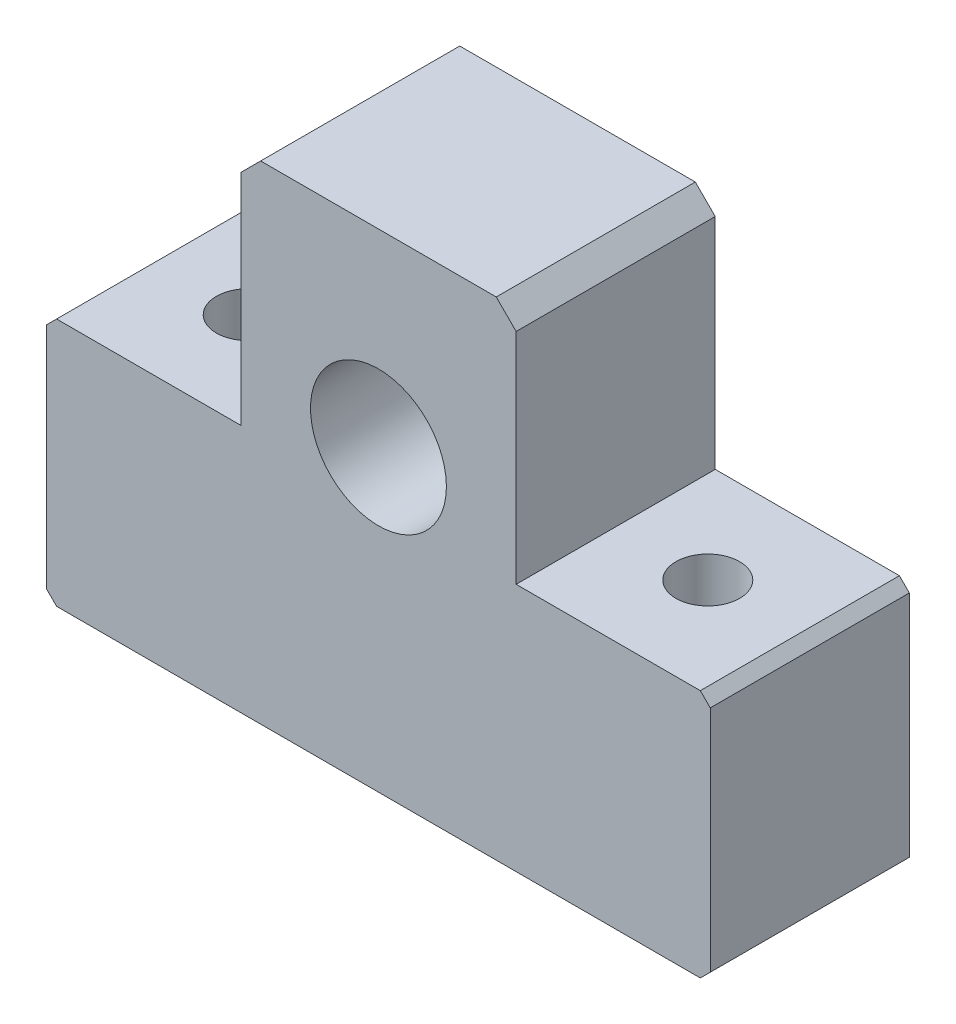
ISO-10303-21;
HEADER;
FILE_DESCRIPTION(('STEP AP214'),'2;1');
FILE_NAME('part.step','',(''),(''),'','','');
FILE_SCHEMA(('AUTOMOTIVE_DESIGN { 1 0 10303 214 1 1 1 1 }'));
ENDSEC;
DATA;
#1=APPLICATION_CONTEXT('core data for automotive mechanical design processes');
#2=APPLICATION_PROTOCOL_DEFINITION('international standard','automotive_design',2000,#1);
#3=PRODUCT_CONTEXT('',#1,'mechanical');
#4=PRODUCT('Part','Part','',(#3));
#5=PRODUCT_RELATED_PRODUCT_CATEGORY('part','',(#4));
#6=PRODUCT_DEFINITION_FORMATION('','',#4);
#7=PRODUCT_DEFINITION_CONTEXT('part definition',#1,'design');
#8=PRODUCT_DEFINITION('design','',#6,#7);
#9=PRODUCT_DEFINITION_SHAPE('','',#8);
#10=(LENGTH_UNIT() NAMED_UNIT(*) SI_UNIT(.MILLI.,.METRE.));
#11=(NAMED_UNIT(*) PLANE_ANGLE_UNIT() SI_UNIT($,.RADIAN.));
#12=(NAMED_UNIT(*) SI_UNIT($,.STERADIAN.) SOLID_ANGLE_UNIT());
#13=UNCERTAINTY_MEASURE_WITH_UNIT(LENGTH_MEASURE(1.E-05),#10,'distance_accuracy_value','');
#14=(GEOMETRIC_REPRESENTATION_CONTEXT(3) GLOBAL_UNCERTAINTY_ASSIGNED_CONTEXT((#13)) GLOBAL_UNIT_ASSIGNED_CONTEXT((#10,
#11,#12)) REPRESENTATION_CONTEXT('',''));
#15=CARTESIAN_POINT('',(0.,0.,0.));
#16=DIRECTION('',(0.,0.,1.));
#17=DIRECTION('',(1.,0.,0.));
#18=AXIS2_PLACEMENT_3D('',#15,#16,#17);
#19=CARTESIAN_POINT('',(0.,0.,150.));
#20=DIRECTION('',(0.,0.,-1.));
#21=DIRECTION('',(-1.,0.,0.));
#22=AXIS2_PLACEMENT_3D('',#19,#20,#21);
#23=PLANE('',#22);
#24=DIRECTION('',(0.,-1.,0.));
#25=VECTOR('',#24,1.);
#26=CARTESIAN_POINT('',(-250.,-176.25,150.));
#27=LINE('',#26,#25);
#28=CARTESIAN_POINT('',(-250.,-3.75,150.));
#29=VERTEX_POINT('',#28);
#30=CARTESIAN_POINT('',(-250.,-176.25,150.));
#31=VERTEX_POINT('',#30);
#32=EDGE_CURVE('E218',#29,#31,#27,.T.);
#33=ORIENTED_EDGE('',*,*,#32,.T.);
#34=DIRECTION('',(0.707106781186548,-0.707106781186548,0.));
#35=VECTOR('',#34,1.);
#36=CARTESIAN_POINT('',(-242.5,-183.75,150.));
#37=LINE('',#36,#35);
#38=CARTESIAN_POINT('',(-242.5,-183.75,150.));
#39=VERTEX_POINT('',#38);
#40=EDGE_CURVE('E118',#31,#39,#37,.T.);
#41=ORIENTED_EDGE('',*,*,#40,.T.);
#42=DIRECTION('',(1.,0.,0.));
#43=VECTOR('',#42,1.);
#44=CARTESIAN_POINT('',(242.5,-183.75,150.));
#45=LINE('',#44,#43);
#46=CARTESIAN_POINT('',(242.5,-183.75,150.));
#47=VERTEX_POINT('',#46);
#48=EDGE_CURVE('E263',#39,#47,#45,.T.);
#49=ORIENTED_EDGE('',*,*,#48,.T.);
#50=DIRECTION('',(0.707106781186548,0.707106781186548,0.));
#51=VECTOR('',#50,1.);
#52=CARTESIAN_POINT('',(242.5,-183.75,150.));
#53=LINE('',#52,#51);
#54=CARTESIAN_POINT('',(250.,-176.25,150.));
#55=VERTEX_POINT('',#54);
#56=EDGE_CURVE('E283',#47,#55,#53,.T.);
#57=ORIENTED_EDGE('',*,*,#56,.T.);
#58=DIRECTION('',(0.,1.,0.));
#59=VECTOR('',#58,1.);
#60=CARTESIAN_POINT('',(250.,-176.25,150.));
#61=LINE('',#60,#59);
#62=CARTESIAN_POINT('',(250.,-3.75000000000002,150.));
#63=VERTEX_POINT('',#62);
#64=EDGE_CURVE('E279',#55,#63,#61,.T.);
#65=ORIENTED_EDGE('',*,*,#64,.T.);
#66=DIRECTION('',(-0.707106781186545,0.70710678118655,0.));
#67=VECTOR('',#66,1.);
#68=CARTESIAN_POINT('',(250.,-3.75000000000002,150.));
#69=LINE('',#68,#67);
#70=CARTESIAN_POINT('',(242.5,3.74999999999998,150.));
#71=VERTEX_POINT('',#70);
#72=EDGE_CURVE('E282',#63,#71,#69,.T.);
#73=ORIENTED_EDGE('',*,*,#72,.T.);
#74=DIRECTION('',(-1.,0.,0.));
#75=VECTOR('',#74,1.);
#76=CARTESIAN_POINT('',(242.5,3.74999999999998,150.));
#77=LINE('',#76,#75);
#78=CARTESIAN_POINT('',(103.75,3.75,150.));
#79=VERTEX_POINT('',#78);
#80=EDGE_CURVE('E287',#71,#79,#77,.T.);
#81=ORIENTED_EDGE('',*,*,#80,.T.);
#82=DIRECTION('',(0.,1.,0.));
#83=VECTOR('',#82,1.);
#84=CARTESIAN_POINT('',(103.75,3.75,150.));
#85=LINE('',#84,#83);
#86=CARTESIAN_POINT('',(103.75,168.75,150.));
#87=VERTEX_POINT('',#86);
#88=EDGE_CURVE('E294',#79,#87,#85,.T.);
#89=ORIENTED_EDGE('',*,*,#88,.T.);
#90=DIRECTION('',(-0.707106781186549,0.707106781186545,0.));
#91=VECTOR('',#90,1.);
#92=CARTESIAN_POINT('',(103.75,168.75,150.));
#93=LINE('',#92,#91);
#94=CARTESIAN_POINT('',(88.75,183.75,150.));
#95=VERTEX_POINT('',#94);
#96=EDGE_CURVE('E297',#87,#95,#93,.T.);
#97=ORIENTED_EDGE('',*,*,#96,.T.);
#98=DIRECTION('',(-1.,0.,0.));
#99=VECTOR('',#98,1.);
#100=CARTESIAN_POINT('',(-88.75,183.75,150.));
#101=LINE('',#100,#99);
#102=CARTESIAN_POINT('',(-88.75,183.75,150.));
#103=VERTEX_POINT('',#102);
#104=EDGE_CURVE('E300',#95,#103,#101,.T.);
#105=ORIENTED_EDGE('',*,*,#104,.T.);
#106=DIRECTION('',(-0.707106781186549,-0.707106781186545,0.));
#107=VECTOR('',#106,1.);
#108=CARTESIAN_POINT('',(-103.75,168.75,150.));
#109=LINE('',#108,#107);
#110=CARTESIAN_POINT('',(-103.75,168.75,150.));
#111=VERTEX_POINT('',#110);
#112=EDGE_CURVE('E155',#103,#111,#109,.T.);
#113=ORIENTED_EDGE('',*,*,#112,.T.);
#114=DIRECTION('',(0.,-1.,0.));
#115=VECTOR('',#114,1.);
#116=CARTESIAN_POINT('',(-103.75,3.75,150.));
#117=LINE('',#116,#115);
#118=CARTESIAN_POINT('',(-103.75,3.75,150.));
#119=VERTEX_POINT('',#118);
#120=EDGE_CURVE('E149',#111,#119,#117,.T.);
#121=ORIENTED_EDGE('',*,*,#120,.T.);
#122=DIRECTION('',(-1.,0.,0.));
#123=VECTOR('',#122,1.);
#124=CARTESIAN_POINT('',(-242.5,3.75,150.));
#125=LINE('',#124,#123);
#126=CARTESIAN_POINT('',(-242.5,3.75,150.));
#127=VERTEX_POINT('',#126);
#128=EDGE_CURVE('E153',#119,#127,#125,.T.);
#129=ORIENTED_EDGE('',*,*,#128,.T.);
#130=DIRECTION('',(-0.707106781186545,-0.70710678118655,0.));
#131=VECTOR('',#130,1.);
#132=CARTESIAN_POINT('',(-250.,-3.75,150.));
#133=LINE('',#132,#131);
#134=EDGE_CURVE('E57',#127,#29,#133,.T.);
#135=ORIENTED_EDGE('',*,*,#134,.T.);
#136=EDGE_LOOP('',(#33,#41,#49,#57,#65,#73,#81,#89,#97,#105,#113,#121,#129,#135));
#137=FACE_BOUND('',#136,.T.);
#138=CARTESIAN_POINT('',(0.,41.25,150.));
#139=DIRECTION('',(0.,0.,1.));
#140=DIRECTION('',(1.,0.,0.));
#141=AXIS2_PLACEMENT_3D('',#138,#139,#140);
#142=CIRCLE('',#141,51.2);
#143=CARTESIAN_POINT('',(51.2,41.25,150.));
#144=VERTEX_POINT('',#143);
#145=EDGE_CURVE('E182',#144,#144,#142,.T.);
#146=ORIENTED_EDGE('',*,*,#145,.F.);
#147=EDGE_LOOP('',(#146));
#148=FACE_BOUND('',#147,.T.);
#149=ADVANCED_FACE('F39',(#137,#148),#23,.F.);
#150=CARTESIAN_POINT('',(0.,0.,0.));
#151=DIRECTION('',(0.,0.,-1.));
#152=DIRECTION('',(-1.,0.,0.));
#153=AXIS2_PLACEMENT_3D('',#150,#151,#152);
#154=PLANE('',#153);
#155=DIRECTION('',(0.,-1.,0.));
#156=VECTOR('',#155,1.);
#157=CARTESIAN_POINT('',(-250.,-176.25,0.));
#158=LINE('',#157,#156);
#159=CARTESIAN_POINT('',(-250.,-3.75,0.));
#160=VERTEX_POINT('',#159);
#161=CARTESIAN_POINT('',(-250.,-176.25,0.));
#162=VERTEX_POINT('',#161);
#163=EDGE_CURVE('E177',#160,#162,#158,.T.);
#164=ORIENTED_EDGE('',*,*,#163,.F.);
#165=DIRECTION('',(-0.707106781186545,-0.70710678118655,0.));
#166=VECTOR('',#165,1.);
#167=CARTESIAN_POINT('',(-250.,-3.75,0.));
#168=LINE('',#167,#166);
#169=CARTESIAN_POINT('',(-242.5,3.75,0.));
#170=VERTEX_POINT('',#169);
#171=EDGE_CURVE('E110',#170,#160,#168,.T.);
#172=ORIENTED_EDGE('',*,*,#171,.F.);
#173=DIRECTION('',(-1.,0.,0.));
#174=VECTOR('',#173,1.);
#175=CARTESIAN_POINT('',(-242.5,3.75,0.));
#176=LINE('',#175,#174);
#177=CARTESIAN_POINT('',(-103.75,3.75,0.));
#178=VERTEX_POINT('',#177);
#179=EDGE_CURVE('E104',#178,#170,#176,.T.);
#180=ORIENTED_EDGE('',*,*,#179,.F.);
#181=DIRECTION('',(0.,-1.,0.));
#182=VECTOR('',#181,1.);
#183=CARTESIAN_POINT('',(-103.75,3.75,0.));
#184=LINE('',#183,#182);
#185=CARTESIAN_POINT('',(-103.75,168.75,0.));
#186=VERTEX_POINT('',#185);
#187=EDGE_CURVE('E164',#186,#178,#184,.T.);
#188=ORIENTED_EDGE('',*,*,#187,.F.);
#189=DIRECTION('',(-0.707106781186549,-0.707106781186545,0.));
#190=VECTOR('',#189,1.);
#191=CARTESIAN_POINT('',(-103.75,168.75,0.));
#192=LINE('',#191,#190);
#193=CARTESIAN_POINT('',(-88.75,183.75,0.));
#194=VERTEX_POINT('',#193);
#195=EDGE_CURVE('E209',#194,#186,#192,.T.);
#196=ORIENTED_EDGE('',*,*,#195,.F.);
#197=DIRECTION('',(-1.,0.,0.));
#198=VECTOR('',#197,1.);
#199=CARTESIAN_POINT('',(-88.75,183.75,0.));
#200=LINE('',#199,#198);
#201=CARTESIAN_POINT('',(88.75,183.75,0.));
#202=VERTEX_POINT('',#201);
#203=EDGE_CURVE('E206',#202,#194,#200,.T.);
#204=ORIENTED_EDGE('',*,*,#203,.F.);
#205=DIRECTION('',(-0.707106781186549,0.707106781186545,0.));
#206=VECTOR('',#205,1.);
#207=CARTESIAN_POINT('',(103.75,168.75,0.));
#208=LINE('',#207,#206);
#209=CARTESIAN_POINT('',(103.75,168.75,0.));
#210=VERTEX_POINT('',#209);
#211=EDGE_CURVE('E203',#210,#202,#208,.T.);
#212=ORIENTED_EDGE('',*,*,#211,.F.);
#213=DIRECTION('',(0.,1.,0.));
#214=VECTOR('',#213,1.);
#215=CARTESIAN_POINT('',(103.75,3.75,0.));
#216=LINE('',#215,#214);
#217=CARTESIAN_POINT('',(103.75,3.75,0.));
#218=VERTEX_POINT('',#217);
#219=EDGE_CURVE('E200',#218,#210,#216,.T.);
#220=ORIENTED_EDGE('',*,*,#219,.F.);
#221=DIRECTION('',(-1.,0.,0.));
#222=VECTOR('',#221,1.);
#223=CARTESIAN_POINT('',(242.5,3.74999999999998,0.));
#224=LINE('',#223,#222);
#225=CARTESIAN_POINT('',(242.5,3.74999999999998,0.));
#226=VERTEX_POINT('',#225);
#227=EDGE_CURVE('E197',#226,#218,#224,.T.);
#228=ORIENTED_EDGE('',*,*,#227,.F.);
#229=DIRECTION('',(-0.707106781186545,0.70710678118655,0.));
#230=VECTOR('',#229,1.);
#231=CARTESIAN_POINT('',(250.,-3.75000000000002,0.));
#232=LINE('',#231,#230);
#233=CARTESIAN_POINT('',(250.,-3.75000000000002,0.));
#234=VERTEX_POINT('',#233);
#235=EDGE_CURVE('E194',#234,#226,#232,.T.);
#236=ORIENTED_EDGE('',*,*,#235,.F.);
#237=DIRECTION('',(0.,1.,0.));
#238=VECTOR('',#237,1.);
#239=CARTESIAN_POINT('',(250.,-176.25,0.));
#240=LINE('',#239,#238);
#241=CARTESIAN_POINT('',(250.,-176.25,0.));
#242=VERTEX_POINT('',#241);
#243=EDGE_CURVE('E191',#242,#234,#240,.T.);
#244=ORIENTED_EDGE('',*,*,#243,.F.);
#245=DIRECTION('',(0.707106781186548,0.707106781186548,0.));
#246=VECTOR('',#245,1.);
#247=CARTESIAN_POINT('',(242.5,-183.75,0.));
#248=LINE('',#247,#246);
#249=CARTESIAN_POINT('',(242.5,-183.75,0.));
#250=VERTEX_POINT('',#249);
#251=EDGE_CURVE('E188',#250,#242,#248,.T.);
#252=ORIENTED_EDGE('',*,*,#251,.F.);
#253=DIRECTION('',(1.,0.,0.));
#254=VECTOR('',#253,1.);
#255=CARTESIAN_POINT('',(242.5,-183.75,0.));
#256=LINE('',#255,#254);
#257=CARTESIAN_POINT('',(-242.5,-183.75,0.));
#258=VERTEX_POINT('',#257);
#259=EDGE_CURVE('E185',#258,#250,#256,.T.);
#260=ORIENTED_EDGE('',*,*,#259,.F.);
#261=DIRECTION('',(0.707106781186548,-0.707106781186548,0.));
#262=VECTOR('',#261,1.);
#263=CARTESIAN_POINT('',(-242.5,-183.75,0.));
#264=LINE('',#263,#262);
#265=EDGE_CURVE('E181',#162,#258,#264,.T.);
#266=ORIENTED_EDGE('',*,*,#265,.F.);
#267=EDGE_LOOP('',(#164,#172,#180,#188,#196,#204,#212,#220,#228,#236,#244,#252,#260,#266));
#268=FACE_BOUND('',#267,.T.);
#269=CARTESIAN_POINT('',(0.,41.25,0.));
#270=DIRECTION('',(0.,0.,1.));
#271=DIRECTION('',(1.,0.,0.));
#272=AXIS2_PLACEMENT_3D('',#269,#270,#271);
#273=CIRCLE('',#272,51.2);
#274=CARTESIAN_POINT('',(51.2,41.25,0.));
#275=VERTEX_POINT('',#274);
#276=EDGE_CURVE('E362',#275,#275,#273,.T.);
#277=ORIENTED_EDGE('',*,*,#276,.T.);
#278=EDGE_LOOP('',(#277));
#279=FACE_BOUND('',#278,.T.);
#280=ADVANCED_FACE('F267',(#268,#279),#154,.T.);
#281=CARTESIAN_POINT('',(-250.,-176.25,150.));
#282=DIRECTION('',(1.,0.,0.));
#283=DIRECTION('',(0.,0.,-1.));
#284=AXIS2_PLACEMENT_3D('',#281,#282,#283);
#285=PLANE('',#284);
#286=ORIENTED_EDGE('',*,*,#163,.T.);
#287=DIRECTION('',(0.,0.,-1.));
#288=VECTOR('',#287,1.);
#289=CARTESIAN_POINT('',(-250.,-176.25,150.));
#290=LINE('',#289,#288);
#291=EDGE_CURVE('E11',#31,#162,#290,.T.);
#292=ORIENTED_EDGE('',*,*,#291,.F.);
#293=ORIENTED_EDGE('',*,*,#32,.F.);
#294=DIRECTION('',(0.,0.,-1.));
#295=VECTOR('',#294,1.);
#296=CARTESIAN_POINT('',(-250.,-3.75,150.));
#297=LINE('',#296,#295);
#298=EDGE_CURVE('E173',#29,#160,#297,.T.);
#299=ORIENTED_EDGE('',*,*,#298,.T.);
#300=EDGE_LOOP('',(#286,#292,#293,#299));
#301=FACE_BOUND('',#300,.T.);
#302=ADVANCED_FACE('F41',(#301),#285,.F.);
#303=CARTESIAN_POINT('',(-242.5,-183.75,150.));
#304=DIRECTION('',(0.707106781186548,0.707106781186548,0.));
#305=DIRECTION('',(-0.707106781186548,0.707106781186548,0.));
#306=AXIS2_PLACEMENT_3D('',#303,#304,#305);
#307=PLANE('',#306);
#308=ORIENTED_EDGE('',*,*,#265,.T.);
#309=DIRECTION('',(0.,0.,-1.));
#310=VECTOR('',#309,1.);
#311=CARTESIAN_POINT('',(-242.5,-183.75,150.));
#312=LINE('',#311,#310);
#313=EDGE_CURVE('E49',#39,#258,#312,.T.);
#314=ORIENTED_EDGE('',*,*,#313,.F.);
#315=ORIENTED_EDGE('',*,*,#40,.F.);
#316=ORIENTED_EDGE('',*,*,#291,.T.);
#317=EDGE_LOOP('',(#308,#314,#315,#316));
#318=FACE_BOUND('',#317,.T.);
#319=ADVANCED_FACE('F384',(#318),#307,.F.);
#320=CARTESIAN_POINT('',(242.5,-183.75,150.));
#321=DIRECTION('',(0.,1.,0.));
#322=DIRECTION('',(0.,0.,1.));
#323=AXIS2_PLACEMENT_3D('',#320,#321,#322);
#324=PLANE('',#323);
#325=CARTESIAN_POINT('',(173.125,-183.75,75.));
#326=DIRECTION('',(0.,-1.,0.));
#327=DIRECTION('',(0.,0.,1.));
#328=AXIS2_PLACEMENT_3D('',#325,#326,#327);
#329=CIRCLE('',#328,24.);
#330=CARTESIAN_POINT('',(173.125,-183.75,99.));
#331=VERTEX_POINT('',#330);
#332=EDGE_CURVE('E347',#331,#331,#329,.T.);
#333=ORIENTED_EDGE('',*,*,#332,.F.);
#334=EDGE_LOOP('',(#333));
#335=FACE_BOUND('',#334,.T.);
#336=CARTESIAN_POINT('',(-173.125,-183.75,75.));
#337=DIRECTION('',(0.,1.,0.));
#338=DIRECTION('',(0.,0.,1.));
#339=AXIS2_PLACEMENT_3D('',#336,#337,#338);
#340=CIRCLE('',#339,24.);
#341=CARTESIAN_POINT('',(-173.125,-183.75,99.));
#342=VERTEX_POINT('',#341);
#343=EDGE_CURVE('E358',#342,#342,#340,.T.);
#344=ORIENTED_EDGE('',*,*,#343,.T.);
#345=EDGE_LOOP('',(#344));
#346=FACE_BOUND('',#345,.T.);
#347=ORIENTED_EDGE('',*,*,#259,.T.);
#348=DIRECTION('',(0.,0.,-1.));
#349=VECTOR('',#348,1.);
#350=CARTESIAN_POINT('',(242.5,-183.75,150.));
#351=LINE('',#350,#349);
#352=EDGE_CURVE('E253',#47,#250,#351,.T.);
#353=ORIENTED_EDGE('',*,*,#352,.F.);
#354=ORIENTED_EDGE('',*,*,#48,.F.);
#355=ORIENTED_EDGE('',*,*,#313,.T.);
#356=EDGE_LOOP('',(#347,#353,#354,#355));
#357=FACE_BOUND('',#356,.T.);
#358=ADVANCED_FACE('F261',(#335,#346,#357),#324,.F.);
#359=CARTESIAN_POINT('',(242.5,-183.75,150.));
#360=DIRECTION('',(-0.707106781186548,0.707106781186548,0.));
#361=DIRECTION('',(-0.707106781186548,-0.707106781186548,0.));
#362=AXIS2_PLACEMENT_3D('',#359,#360,#361);
#363=PLANE('',#362);
#364=ORIENTED_EDGE('',*,*,#251,.T.);
#365=DIRECTION('',(0.,0.,-1.));
#366=VECTOR('',#365,1.);
#367=CARTESIAN_POINT('',(250.,-176.25,150.));
#368=LINE('',#367,#366);
#369=EDGE_CURVE('E249',#55,#242,#368,.T.);
#370=ORIENTED_EDGE('',*,*,#369,.F.);
#371=ORIENTED_EDGE('',*,*,#56,.F.);
#372=ORIENTED_EDGE('',*,*,#352,.T.);
#373=EDGE_LOOP('',(#364,#370,#371,#372));
#374=FACE_BOUND('',#373,.T.);
#375=ADVANCED_FACE('F273',(#374),#363,.F.);
#376=CARTESIAN_POINT('',(250.,-176.25,150.));
#377=DIRECTION('',(-1.,0.,0.));
#378=DIRECTION('',(0.,0.,1.));
#379=AXIS2_PLACEMENT_3D('',#376,#377,#378);
#380=PLANE('',#379);
#381=ORIENTED_EDGE('',*,*,#243,.T.);
#382=DIRECTION('',(0.,0.,-1.));
#383=VECTOR('',#382,1.);
#384=CARTESIAN_POINT('',(250.,-3.75000000000002,150.));
#385=LINE('',#384,#383);
#386=EDGE_CURVE('E245',#63,#234,#385,.T.);
#387=ORIENTED_EDGE('',*,*,#386,.F.);
#388=ORIENTED_EDGE('',*,*,#64,.F.);
#389=ORIENTED_EDGE('',*,*,#369,.T.);
#390=EDGE_LOOP('',(#381,#387,#388,#389));
#391=FACE_BOUND('',#390,.T.);
#392=ADVANCED_FACE('F277',(#391),#380,.F.);
#393=CARTESIAN_POINT('',(250.,-3.75000000000002,150.));
#394=DIRECTION('',(-0.70710678118655,-0.707106781186545,0.));
#395=DIRECTION('',(0.707106781186545,-0.70710678118655,0.));
#396=AXIS2_PLACEMENT_3D('',#393,#394,#395);
#397=PLANE('',#396);
#398=ORIENTED_EDGE('',*,*,#235,.T.);
#399=DIRECTION('',(0.,0.,-1.));
#400=VECTOR('',#399,1.);
#401=CARTESIAN_POINT('',(242.5,3.74999999999998,150.));
#402=LINE('',#401,#400);
#403=EDGE_CURVE('E241',#71,#226,#402,.T.);
#404=ORIENTED_EDGE('',*,*,#403,.F.);
#405=ORIENTED_EDGE('',*,*,#72,.F.);
#406=ORIENTED_EDGE('',*,*,#386,.T.);
#407=EDGE_LOOP('',(#398,#404,#405,#406));
#408=FACE_BOUND('',#407,.T.);
#409=ADVANCED_FACE('F395',(#408),#397,.F.);
#410=CARTESIAN_POINT('',(242.5,3.74999999999998,150.));
#411=DIRECTION('',(0.,-1.,0.));
#412=DIRECTION('',(1.,0.,0.));
#413=AXIS2_PLACEMENT_3D('',#410,#411,#412);
#414=PLANE('',#413);
#415=CARTESIAN_POINT('',(173.125,3.75,75.));
#416=DIRECTION('',(0.,-1.,0.));
#417=DIRECTION('',(0.,0.,1.));
#418=AXIS2_PLACEMENT_3D('',#415,#416,#417);
#419=CIRCLE('',#418,24.);
#420=CARTESIAN_POINT('',(173.125,3.75,99.));
#421=VERTEX_POINT('',#420);
#422=EDGE_CURVE('E350',#421,#421,#419,.T.);
#423=ORIENTED_EDGE('',*,*,#422,.T.);
#424=EDGE_LOOP('',(#423));
#425=FACE_BOUND('',#424,.T.);
#426=ORIENTED_EDGE('',*,*,#227,.T.);
#427=DIRECTION('',(0.,0.,-1.));
#428=VECTOR('',#427,1.);
#429=CARTESIAN_POINT('',(103.75,3.75,150.));
#430=LINE('',#429,#428);
#431=EDGE_CURVE('E237',#79,#218,#430,.T.);
#432=ORIENTED_EDGE('',*,*,#431,.F.);
#433=ORIENTED_EDGE('',*,*,#80,.F.);
#434=ORIENTED_EDGE('',*,*,#403,.T.);
#435=EDGE_LOOP('',(#426,#432,#433,#434));
#436=FACE_BOUND('',#435,.T.);
#437=ADVANCED_FACE('F398',(#425,#436),#414,.F.);
#438=CARTESIAN_POINT('',(103.75,3.75,150.));
#439=DIRECTION('',(-1.,0.,0.));
#440=DIRECTION('',(0.,0.,1.));
#441=AXIS2_PLACEMENT_3D('',#438,#439,#440);
#442=PLANE('',#441);
#443=ORIENTED_EDGE('',*,*,#219,.T.);
#444=DIRECTION('',(0.,0.,-1.));
#445=VECTOR('',#444,1.);
#446=CARTESIAN_POINT('',(103.75,168.75,150.));
#447=LINE('',#446,#445);
#448=EDGE_CURVE('E233',#87,#210,#447,.T.);
#449=ORIENTED_EDGE('',*,*,#448,.F.);
#450=ORIENTED_EDGE('',*,*,#88,.F.);
#451=ORIENTED_EDGE('',*,*,#431,.T.);
#452=EDGE_LOOP('',(#443,#449,#450,#451));
#453=FACE_BOUND('',#452,.T.);
#454=ADVANCED_FACE('F402',(#453),#442,.F.);
#455=CARTESIAN_POINT('',(103.75,168.75,150.));
#456=DIRECTION('',(-0.707106781186546,-0.707106781186549,0.));
#457=DIRECTION('',(0.707106781186549,-0.707106781186546,0.));
#458=AXIS2_PLACEMENT_3D('',#455,#456,#457);
#459=PLANE('',#458);
#460=ORIENTED_EDGE('',*,*,#211,.T.);
#461=DIRECTION('',(0.,0.,-1.));
#462=VECTOR('',#461,1.);
#463=CARTESIAN_POINT('',(88.75,183.75,150.));
#464=LINE('',#463,#462);
#465=EDGE_CURVE('E229',#95,#202,#464,.T.);
#466=ORIENTED_EDGE('',*,*,#465,.F.);
#467=ORIENTED_EDGE('',*,*,#96,.F.);
#468=ORIENTED_EDGE('',*,*,#448,.T.);
#469=EDGE_LOOP('',(#460,#466,#467,#468));
#470=FACE_BOUND('',#469,.T.);
#471=ADVANCED_FACE('F405',(#470),#459,.F.);
#472=CARTESIAN_POINT('',(-88.75,183.75,150.));
#473=DIRECTION('',(0.,-1.,0.));
#474=DIRECTION('',(0.,0.,-1.));
#475=AXIS2_PLACEMENT_3D('',#472,#473,#474);
#476=PLANE('',#475);
#477=ORIENTED_EDGE('',*,*,#203,.T.);
#478=DIRECTION('',(0.,0.,-1.));
#479=VECTOR('',#478,1.);
#480=CARTESIAN_POINT('',(-88.75,183.75,150.));
#481=LINE('',#480,#479);
#482=EDGE_CURVE('E225',#103,#194,#481,.T.);
#483=ORIENTED_EDGE('',*,*,#482,.F.);
#484=ORIENTED_EDGE('',*,*,#104,.F.);
#485=ORIENTED_EDGE('',*,*,#465,.T.);
#486=EDGE_LOOP('',(#477,#483,#484,#485));
#487=FACE_BOUND('',#486,.T.);
#488=ADVANCED_FACE('F308',(#487),#476,.F.);
#489=CARTESIAN_POINT('',(-103.75,168.75,150.));
#490=DIRECTION('',(0.707106781186546,-0.707106781186549,0.));
#491=DIRECTION('',(0.707106781186549,0.707106781186546,0.));
#492=AXIS2_PLACEMENT_3D('',#489,#490,#491);
#493=PLANE('',#492);
#494=ORIENTED_EDGE('',*,*,#195,.T.);
#495=DIRECTION('',(0.,0.,-1.));
#496=VECTOR('',#495,1.);
#497=CARTESIAN_POINT('',(-103.75,168.75,150.));
#498=LINE('',#497,#496);
#499=EDGE_CURVE('E166',#111,#186,#498,.T.);
#500=ORIENTED_EDGE('',*,*,#499,.F.);
#501=ORIENTED_EDGE('',*,*,#112,.F.);
#502=ORIENTED_EDGE('',*,*,#482,.T.);
#503=EDGE_LOOP('',(#494,#500,#501,#502));
#504=FACE_BOUND('',#503,.T.);
#505=ADVANCED_FACE('F312',(#504),#493,.F.);
#506=CARTESIAN_POINT('',(-103.75,3.75,150.));
#507=DIRECTION('',(1.,0.,0.));
#508=DIRECTION('',(0.,0.,-1.));
#509=AXIS2_PLACEMENT_3D('',#506,#507,#508);
#510=PLANE('',#509);
#511=ORIENTED_EDGE('',*,*,#187,.T.);
#512=DIRECTION('',(0.,0.,-1.));
#513=VECTOR('',#512,1.);
#514=CARTESIAN_POINT('',(-103.75,3.75,150.));
#515=LINE('',#514,#513);
#516=EDGE_CURVE('E161',#119,#178,#515,.T.);
#517=ORIENTED_EDGE('',*,*,#516,.F.);
#518=ORIENTED_EDGE('',*,*,#120,.F.);
#519=ORIENTED_EDGE('',*,*,#499,.T.);
#520=EDGE_LOOP('',(#511,#517,#518,#519));
#521=FACE_BOUND('',#520,.T.);
#522=ADVANCED_FACE('F162',(#521),#510,.F.);
#523=CARTESIAN_POINT('',(-242.5,3.75,150.));
#524=DIRECTION('',(0.,-1.,0.));
#525=DIRECTION('',(0.,0.,-1.));
#526=AXIS2_PLACEMENT_3D('',#523,#524,#525);
#527=PLANE('',#526);
#528=CARTESIAN_POINT('',(-173.125,3.75,75.));
#529=DIRECTION('',(0.,1.,0.));
#530=DIRECTION('',(0.,0.,1.));
#531=AXIS2_PLACEMENT_3D('',#528,#529,#530);
#532=CIRCLE('',#531,24.);
#533=CARTESIAN_POINT('',(-173.125,3.75,99.));
#534=VERTEX_POINT('',#533);
#535=EDGE_CURVE('E355',#534,#534,#532,.T.);
#536=ORIENTED_EDGE('',*,*,#535,.F.);
#537=EDGE_LOOP('',(#536));
#538=FACE_BOUND('',#537,.T.);
#539=ORIENTED_EDGE('',*,*,#179,.T.);
#540=DIRECTION('',(0.,0.,-1.));
#541=VECTOR('',#540,1.);
#542=CARTESIAN_POINT('',(-242.5,3.75,150.));
#543=LINE('',#542,#541);
#544=EDGE_CURVE('E167',#127,#170,#543,.T.);
#545=ORIENTED_EDGE('',*,*,#544,.F.);
#546=ORIENTED_EDGE('',*,*,#128,.F.);
#547=ORIENTED_EDGE('',*,*,#516,.T.);
#548=EDGE_LOOP('',(#539,#545,#546,#547));
#549=FACE_BOUND('',#548,.T.);
#550=ADVANCED_FACE('F169',(#538,#549),#527,.F.);
#551=CARTESIAN_POINT('',(-250.,-3.75,150.));
#552=DIRECTION('',(0.70710678118655,-0.707106781186545,0.));
#553=DIRECTION('',(0.707106781186545,0.70710678118655,0.));
#554=AXIS2_PLACEMENT_3D('',#551,#552,#553);
#555=PLANE('',#554);
#556=ORIENTED_EDGE('',*,*,#171,.T.);
#557=ORIENTED_EDGE('',*,*,#298,.F.);
#558=ORIENTED_EDGE('',*,*,#134,.F.);
#559=ORIENTED_EDGE('',*,*,#544,.T.);
#560=EDGE_LOOP('',(#556,#557,#558,#559));
#561=FACE_BOUND('',#560,.T.);
#562=ADVANCED_FACE('F316',(#561),#555,.F.);
#563=CARTESIAN_POINT('',(0.,41.25,150.));
#564=DIRECTION('',(0.,0.,-1.));
#565=DIRECTION('',(-1.,0.,0.));
#566=AXIS2_PLACEMENT_3D('',#563,#564,#565);
#567=CYLINDRICAL_SURFACE('',#566,51.2);
#568=ORIENTED_EDGE('',*,*,#145,.T.);
#569=EDGE_LOOP('',(#568));
#570=FACE_BOUND('',#569,.T.);
#571=ORIENTED_EDGE('',*,*,#276,.F.);
#572=EDGE_LOOP('',(#571));
#573=FACE_BOUND('',#572,.T.);
#574=ADVANCED_FACE('F318',(#570,#573),#567,.F.);
#575=CARTESIAN_POINT('',(-173.125,-183.75,75.));
#576=DIRECTION('',(0.,1.,0.));
#577=DIRECTION('',(0.,0.,1.));
#578=AXIS2_PLACEMENT_3D('',#575,#576,#577);
#579=CYLINDRICAL_SURFACE('',#578,24.);
#580=ORIENTED_EDGE('',*,*,#343,.F.);
#581=EDGE_LOOP('',(#580));
#582=FACE_BOUND('',#581,.T.);
#583=ORIENTED_EDGE('',*,*,#535,.T.);
#584=EDGE_LOOP('',(#583));
#585=FACE_BOUND('',#584,.T.);
#586=ADVANCED_FACE('F324',(#582,#585),#579,.F.);
#587=CARTESIAN_POINT('',(173.125,-183.75,75.));
#588=DIRECTION('',(0.,1.,0.));
#589=DIRECTION('',(0.,0.,1.));
#590=AXIS2_PLACEMENT_3D('',#587,#588,#589);
#591=CYLINDRICAL_SURFACE('',#590,24.);
#592=ORIENTED_EDGE('',*,*,#332,.T.);
#593=EDGE_LOOP('',(#592));
#594=FACE_BOUND('',#593,.T.);
#595=ORIENTED_EDGE('',*,*,#422,.F.);
#596=EDGE_LOOP('',(#595));
#597=FACE_BOUND('',#596,.T.);
#598=ADVANCED_FACE('F338',(#594,#597),#591,.F.);
#599=CLOSED_SHELL('',(#149,#280,#302,#319,#358,#375,#392,#409,#437,#454,#471,#488,#505,#522,
#550,#562,#574,#586,#598));
#600=MANIFOLD_SOLID_BREP('B2',#599);
#601=ADVANCED_BREP_SHAPE_REPRESENTATION('',(#18,#600),#14);
#602=SHAPE_DEFINITION_REPRESENTATION(#9,#601);
ENDSEC;
END-ISO-10303-21;
